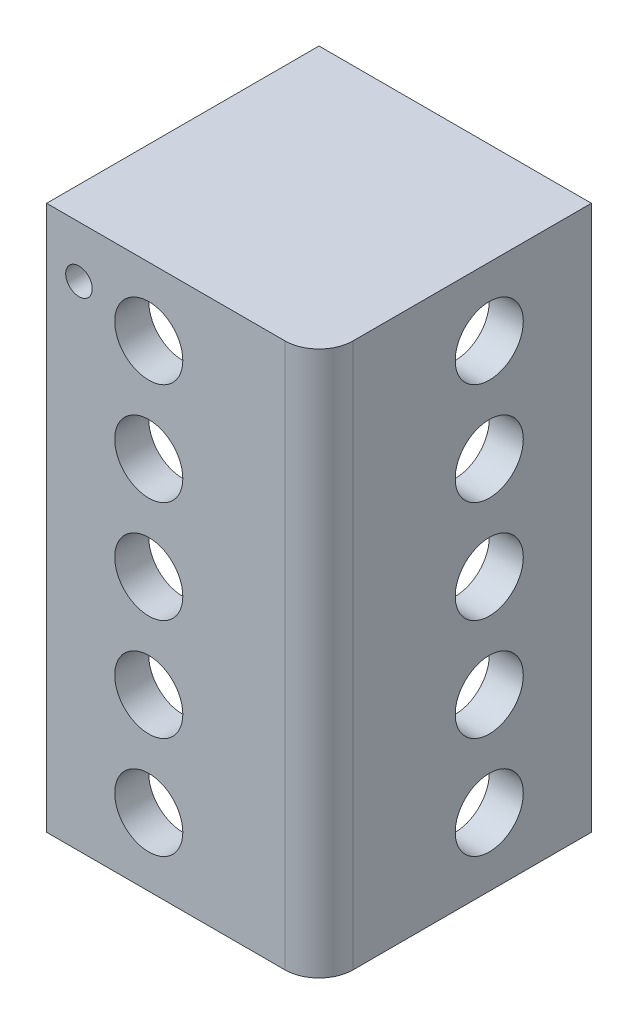
ISO-10303-21;
HEADER;
FILE_DESCRIPTION(('STEP AP214'),'2;1');
FILE_NAME('part.step','',(''),(''),'','','');
FILE_SCHEMA(('AUTOMOTIVE_DESIGN { 1 0 10303 214 1 1 1 1 }'));
ENDSEC;
DATA;
#1=APPLICATION_CONTEXT('core data for automotive mechanical design processes');
#2=APPLICATION_PROTOCOL_DEFINITION('international standard','automotive_design',2000,#1);
#3=PRODUCT_CONTEXT('',#1,'mechanical');
#4=PRODUCT('Part','Part','',(#3));
#5=PRODUCT_RELATED_PRODUCT_CATEGORY('part','',(#4));
#6=PRODUCT_DEFINITION_FORMATION('','',#4);
#7=PRODUCT_DEFINITION_CONTEXT('part definition',#1,'design');
#8=PRODUCT_DEFINITION('design','',#6,#7);
#9=PRODUCT_DEFINITION_SHAPE('','',#8);
#10=(LENGTH_UNIT() NAMED_UNIT(*) SI_UNIT(.MILLI.,.METRE.));
#11=(NAMED_UNIT(*) PLANE_ANGLE_UNIT() SI_UNIT($,.RADIAN.));
#12=(NAMED_UNIT(*) SI_UNIT($,.STERADIAN.) SOLID_ANGLE_UNIT());
#13=UNCERTAINTY_MEASURE_WITH_UNIT(LENGTH_MEASURE(1.E-05),#10,'distance_accuracy_value','');
#14=(GEOMETRIC_REPRESENTATION_CONTEXT(3) GLOBAL_UNCERTAINTY_ASSIGNED_CONTEXT((#13)) GLOBAL_UNIT_ASSIGNED_CONTEXT((#10,
#11,#12)) REPRESENTATION_CONTEXT('',''));
#15=CARTESIAN_POINT('',(0.,0.,0.));
#16=DIRECTION('',(0.,0.,1.));
#17=DIRECTION('',(1.,0.,0.));
#18=AXIS2_PLACEMENT_3D('',#15,#16,#17);
#19=CARTESIAN_POINT('',(0.,196.85,0.));
#20=DIRECTION('',(0.,1.,0.));
#21=DIRECTION('',(0.,0.,1.));
#22=AXIS2_PLACEMENT_3D('',#19,#20,#21);
#23=PLANE('',#22);
#24=DIRECTION('',(1.,0.,0.));
#25=VECTOR('',#24,1.);
#26=CARTESIAN_POINT('',(-41.3514223194748,196.85,-6.62789934354485));
#27=LINE('',#26,#25);
#28=CARTESIAN_POINT('',(-41.3514223194748,196.85,-6.62789934354485));
#29=VERTEX_POINT('',#28);
#30=CARTESIAN_POINT('',(-18.4914223194748,196.85,-6.62789934354485));
#31=VERTEX_POINT('',#30);
#32=EDGE_CURVE('E220',#29,#31,#27,.T.);
#33=ORIENTED_EDGE('',*,*,#32,.F.);
#34=DIRECTION('',(0.,0.,1.));
#35=VECTOR('',#34,1.);
#36=CARTESIAN_POINT('',(-41.3514223194748,196.85,-76.4778993435448));
#37=LINE('',#36,#35);
#38=CARTESIAN_POINT('',(-41.3514223194748,196.85,-18.5658993435449));
#39=VERTEX_POINT('',#38);
#40=EDGE_CURVE('E208',#39,#29,#37,.T.);
#41=ORIENTED_EDGE('',*,*,#40,.F.);
#42=DIRECTION('',(-1.,0.,0.));
#43=VECTOR('',#42,1.);
#44=CARTESIAN_POINT('',(-41.3514223194748,196.85,-18.5658993435449));
#45=LINE('',#44,#43);
#46=CARTESIAN_POINT('',(-18.4914223194748,196.85,-18.5658993435449));
#47=VERTEX_POINT('',#46);
#48=EDGE_CURVE('E240',#47,#39,#45,.T.);
#49=ORIENTED_EDGE('',*,*,#48,.F.);
#50=DIRECTION('',(0.,0.,1.));
#51=VECTOR('',#50,1.);
#52=CARTESIAN_POINT('',(-18.4914223194748,196.85,-18.5658993435449));
#53=LINE('',#52,#51);
#54=CARTESIAN_POINT('',(-18.4914223194748,196.85,-27.4558993435448));
#55=VERTEX_POINT('',#54);
#56=EDGE_CURVE('E243',#55,#47,#53,.T.);
#57=ORIENTED_EDGE('',*,*,#56,.F.);
#58=DIRECTION('',(1.,0.,0.));
#59=VECTOR('',#58,1.);
#60=CARTESIAN_POINT('',(-41.3514223194748,196.85,-27.4558993435448));
#61=LINE('',#60,#59);
#62=CARTESIAN_POINT('',(-41.3514223194748,196.85,-27.4558993435448));
#63=VERTEX_POINT('',#62);
#64=EDGE_CURVE('E247',#63,#55,#61,.T.);
#65=ORIENTED_EDGE('',*,*,#64,.F.);
#66=CARTESIAN_POINT('',(-41.3514223194748,196.85,-76.4778993435448));
#67=VERTEX_POINT('',#66);
#68=EDGE_CURVE('E211',#67,#63,#37,.T.);
#69=ORIENTED_EDGE('',*,*,#68,.F.);
#70=DIRECTION('',(-1.,0.,0.));
#71=VECTOR('',#70,1.);
#72=CARTESIAN_POINT('',(-41.3514223194748,196.85,-76.4778993435448));
#73=LINE('',#72,#71);
#74=CARTESIAN_POINT('',(47.5485776805252,196.85,-76.4778993435448));
#75=VERTEX_POINT('',#74);
#76=EDGE_CURVE('E298',#75,#67,#73,.T.);
#77=ORIENTED_EDGE('',*,*,#76,.F.);
#78=DIRECTION('',(0.,0.,-1.));
#79=VECTOR('',#78,1.);
#80=CARTESIAN_POINT('',(47.5485776805252,196.85,-76.4778993435448));
#81=LINE('',#80,#79);
#82=CARTESIAN_POINT('',(47.5485776805252,196.85,-0.277899343544857));
#83=VERTEX_POINT('',#82);
#84=EDGE_CURVE('E296',#83,#75,#81,.T.);
#85=ORIENTED_EDGE('',*,*,#84,.F.);
#86=CARTESIAN_POINT('',(34.8485776805252,196.85,-0.277899343544857));
#87=DIRECTION('',(0.,1.,0.));
#88=DIRECTION('',(0.,0.,1.));
#89=AXIS2_PLACEMENT_3D('',#86,#87,#88);
#90=CIRCLE('',#89,12.7);
#91=CARTESIAN_POINT('',(34.8485776805252,196.85,12.4221006564551));
#92=VERTEX_POINT('',#91);
#93=EDGE_CURVE('E347',#83,#92,#90,.F.);
#94=ORIENTED_EDGE('',*,*,#93,.T.);
#95=DIRECTION('',(1.,0.,0.));
#96=VECTOR('',#95,1.);
#97=CARTESIAN_POINT('',(-41.3514223194748,196.85,12.4221006564551));
#98=LINE('',#97,#96);
#99=CARTESIAN_POINT('',(-41.3514223194748,196.85,12.4221006564551));
#100=VERTEX_POINT('',#99);
#101=EDGE_CURVE('E206',#100,#92,#98,.T.);
#102=ORIENTED_EDGE('',*,*,#101,.F.);
#103=CARTESIAN_POINT('',(-41.3514223194748,196.85,2.26210065645514));
#104=VERTEX_POINT('',#103);
#105=EDGE_CURVE('E188',#104,#100,#37,.T.);
#106=ORIENTED_EDGE('',*,*,#105,.F.);
#107=DIRECTION('',(-1.,0.,0.));
#108=VECTOR('',#107,1.);
#109=CARTESIAN_POINT('',(-41.3514223194748,196.85,2.26210065645514));
#110=LINE('',#109,#108);
#111=CARTESIAN_POINT('',(-18.4914223194748,196.85,2.26210065645515));
#112=VERTEX_POINT('',#111);
#113=EDGE_CURVE('E203',#112,#104,#110,.T.);
#114=ORIENTED_EDGE('',*,*,#113,.F.);
#115=DIRECTION('',(0.,0.,1.));
#116=VECTOR('',#115,1.);
#117=CARTESIAN_POINT('',(-18.4914223194748,196.85,2.26210065645515));
#118=LINE('',#117,#116);
#119=EDGE_CURVE('E216',#31,#112,#118,.T.);
#120=ORIENTED_EDGE('',*,*,#119,.F.);
#121=EDGE_LOOP('',(#33,#41,#49,#57,#65,#69,#77,#85,#94,#102,#106,#114,#120));
#122=FACE_BOUND('',#121,.T.);
#123=ADVANCED_FACE('F43',(#122),#23,.F.);
#124=CARTESIAN_POINT('',(-41.3514223194748,203.2,-76.4778993435448));
#125=DIRECTION('',(1.,0.,0.));
#126=DIRECTION('',(0.,0.,-1.));
#127=AXIS2_PLACEMENT_3D('',#124,#125,#126);
#128=PLANE('',#127);
#129=DIRECTION('',(0.,1.,0.));
#130=VECTOR('',#129,1.);
#131=CARTESIAN_POINT('',(-41.3514223194748,171.45,-6.62789934354485));
#132=LINE('',#131,#130);
#133=CARTESIAN_POINT('',(-41.3514223194748,184.15,-6.62789934354485));
#134=VERTEX_POINT('',#133);
#135=EDGE_CURVE('E227',#134,#29,#132,.T.);
#136=ORIENTED_EDGE('',*,*,#135,.F.);
#137=DIRECTION('',(0.,0.,-1.));
#138=VECTOR('',#137,1.);
#139=CARTESIAN_POINT('',(-41.3514223194748,184.15,2.26210065645514));
#140=LINE('',#139,#138);
#141=CARTESIAN_POINT('',(-41.3514223194748,184.15,2.26210065645514));
#142=VERTEX_POINT('',#141);
#143=EDGE_CURVE('E191',#134,#142,#140,.F.);
#144=ORIENTED_EDGE('',*,*,#143,.T.);
#145=DIRECTION('',(0.,1.,0.));
#146=VECTOR('',#145,1.);
#147=CARTESIAN_POINT('',(-41.3514223194748,171.45,2.26210065645514));
#148=LINE('',#147,#146);
#149=EDGE_CURVE('E184',#142,#104,#148,.T.);
#150=ORIENTED_EDGE('',*,*,#149,.T.);
#151=ORIENTED_EDGE('',*,*,#105,.T.);
#152=DIRECTION('',(0.,-1.,0.));
#153=VECTOR('',#152,1.);
#154=CARTESIAN_POINT('',(-41.3514223194748,196.85,12.4221006564551));
#155=LINE('',#154,#153);
#156=CARTESIAN_POINT('',(-41.3514223194748,0.,12.4221006564551));
#157=VERTEX_POINT('',#156);
#158=EDGE_CURVE('E303',#100,#157,#155,.T.);
#159=ORIENTED_EDGE('',*,*,#158,.T.);
#160=DIRECTION('',(0.,0.,1.));
#161=VECTOR('',#160,1.);
#162=CARTESIAN_POINT('',(-41.3514223194748,0.,-76.4778993435448));
#163=LINE('',#162,#161);
#164=CARTESIAN_POINT('',(-41.3514223194748,0.,25.1221006564551));
#165=VERTEX_POINT('',#164);
#166=EDGE_CURVE('E305',#157,#165,#163,.T.);
#167=ORIENTED_EDGE('',*,*,#166,.T.);
#168=DIRECTION('',(0.,-1.,0.));
#169=VECTOR('',#168,1.);
#170=CARTESIAN_POINT('',(-41.3514223194748,203.2,25.1221006564551));
#171=LINE('',#170,#169);
#172=CARTESIAN_POINT('',(-41.3514223194748,203.2,25.1221006564551));
#173=VERTEX_POINT('',#172);
#174=EDGE_CURVE('E331',#173,#165,#171,.T.);
#175=ORIENTED_EDGE('',*,*,#174,.F.);
#176=DIRECTION('',(0.,0.,1.));
#177=VECTOR('',#176,1.);
#178=CARTESIAN_POINT('',(-41.3514223194748,203.2,-76.4778993435448));
#179=LINE('',#178,#177);
#180=CARTESIAN_POINT('',(-41.3514223194748,203.2,-76.4778993435448));
#181=VERTEX_POINT('',#180);
#182=EDGE_CURVE('E306',#181,#173,#179,.T.);
#183=ORIENTED_EDGE('',*,*,#182,.F.);
#184=DIRECTION('',(0.,-1.,0.));
#185=VECTOR('',#184,1.);
#186=CARTESIAN_POINT('',(-41.3514223194748,203.2,-76.4778993435448));
#187=LINE('',#186,#185);
#188=EDGE_CURVE('E317',#181,#67,#187,.T.);
#189=ORIENTED_EDGE('',*,*,#188,.T.);
#190=ORIENTED_EDGE('',*,*,#68,.T.);
#191=DIRECTION('',(0.,1.,0.));
#192=VECTOR('',#191,1.);
#193=CARTESIAN_POINT('',(-41.3514223194748,171.45,-27.4558993435448));
#194=LINE('',#193,#192);
#195=CARTESIAN_POINT('',(-41.3514223194748,184.15,-27.4558993435448));
#196=VERTEX_POINT('',#195);
#197=EDGE_CURVE('E230',#196,#63,#194,.T.);
#198=ORIENTED_EDGE('',*,*,#197,.F.);
#199=DIRECTION('',(0.,0.,-1.));
#200=VECTOR('',#199,1.);
#201=CARTESIAN_POINT('',(-41.3514223194748,184.15,-18.5658993435449));
#202=LINE('',#201,#200);
#203=CARTESIAN_POINT('',(-41.3514223194748,184.15,-18.5658993435449));
#204=VERTEX_POINT('',#203);
#205=EDGE_CURVE('E380',#196,#204,#202,.F.);
#206=ORIENTED_EDGE('',*,*,#205,.T.);
#207=DIRECTION('',(0.,1.,0.));
#208=VECTOR('',#207,1.);
#209=CARTESIAN_POINT('',(-41.3514223194748,171.45,-18.5658993435449));
#210=LINE('',#209,#208);
#211=EDGE_CURVE('E237',#204,#39,#210,.T.);
#212=ORIENTED_EDGE('',*,*,#211,.T.);
#213=ORIENTED_EDGE('',*,*,#40,.T.);
#214=EDGE_LOOP('',(#136,#144,#150,#151,#159,#167,#175,#183,#189,#190,#198,#206,#212,#213));
#215=FACE_BOUND('',#214,.T.);
#216=ADVANCED_FACE('F187',(#215),#128,.F.);
#217=CARTESIAN_POINT('',(-41.3514223194748,203.2,25.1221006564551));
#218=DIRECTION('',(0.,0.,-1.));
#219=DIRECTION('',(-1.,0.,0.));
#220=AXIS2_PLACEMENT_3D('',#217,#218,#219);
#221=PLANE('',#220);
#222=CARTESIAN_POINT('',(-29.2864223194748,184.023,25.1221006564552));
#223=DIRECTION('',(0.,0.,-1.));
#224=DIRECTION('',(-1.,0.,0.));
#225=AXIS2_PLACEMENT_3D('',#222,#223,#224);
#226=CIRCLE('',#225,4.953);
#227=CARTESIAN_POINT('',(-34.2394223194748,184.023,25.1221006564552));
#228=VERTEX_POINT('',#227);
#229=EDGE_CURVE('E671',#228,#228,#226,.T.);
#230=ORIENTED_EDGE('',*,*,#229,.T.);
#231=EDGE_LOOP('',(#230));
#232=FACE_BOUND('',#231,.T.);
#233=CARTESIAN_POINT('',(-3.25142231947483,177.8,25.1221006564551));
#234=DIRECTION('',(0.,0.,1.));
#235=DIRECTION('',(1.,0.,0.));
#236=AXIS2_PLACEMENT_3D('',#233,#234,#235);
#237=CIRCLE('',#236,12.7);
#238=CARTESIAN_POINT('',(9.44857768052517,177.8,25.1221006564551));
#239=VERTEX_POINT('',#238);
#240=EDGE_CURVE('E277',#239,#239,#237,.T.);
#241=ORIENTED_EDGE('',*,*,#240,.F.);
#242=EDGE_LOOP('',(#241));
#243=FACE_BOUND('',#242,.T.);
#244=CARTESIAN_POINT('',(-3.25142231947483,139.7,25.1221006564551));
#245=DIRECTION('',(0.,0.,1.));
#246=DIRECTION('',(1.,0.,0.));
#247=AXIS2_PLACEMENT_3D('',#244,#245,#246);
#248=CIRCLE('',#247,12.7);
#249=CARTESIAN_POINT('',(9.44857768052517,139.7,25.1221006564551));
#250=VERTEX_POINT('',#249);
#251=EDGE_CURVE('E281',#250,#250,#248,.T.);
#252=ORIENTED_EDGE('',*,*,#251,.F.);
#253=EDGE_LOOP('',(#252));
#254=FACE_BOUND('',#253,.T.);
#255=CARTESIAN_POINT('',(-3.25142231947483,101.6,25.1221006564551));
#256=DIRECTION('',(0.,0.,1.));
#257=DIRECTION('',(1.,0.,0.));
#258=AXIS2_PLACEMENT_3D('',#255,#256,#257);
#259=CIRCLE('',#258,12.7);
#260=CARTESIAN_POINT('',(9.44857768052517,101.6,25.1221006564551));
#261=VERTEX_POINT('',#260);
#262=EDGE_CURVE('E284',#261,#261,#259,.T.);
#263=ORIENTED_EDGE('',*,*,#262,.F.);
#264=EDGE_LOOP('',(#263));
#265=FACE_BOUND('',#264,.T.);
#266=CARTESIAN_POINT('',(-3.25142231947483,63.5,25.1221006564551));
#267=DIRECTION('',(0.,0.,1.));
#268=DIRECTION('',(1.,0.,0.));
#269=AXIS2_PLACEMENT_3D('',#266,#267,#268);
#270=CIRCLE('',#269,12.7);
#271=CARTESIAN_POINT('',(9.44857768052517,63.5,25.1221006564551));
#272=VERTEX_POINT('',#271);
#273=EDGE_CURVE('E287',#272,#272,#270,.T.);
#274=ORIENTED_EDGE('',*,*,#273,.F.);
#275=EDGE_LOOP('',(#274));
#276=FACE_BOUND('',#275,.T.);
#277=CARTESIAN_POINT('',(-3.25142231947483,25.4,25.1221006564551));
#278=DIRECTION('',(0.,0.,1.));
#279=DIRECTION('',(1.,0.,0.));
#280=AXIS2_PLACEMENT_3D('',#277,#278,#279);
#281=CIRCLE('',#280,12.7);
#282=CARTESIAN_POINT('',(9.44857768052517,25.4,25.1221006564551));
#283=VERTEX_POINT('',#282);
#284=EDGE_CURVE('E290',#283,#283,#281,.T.);
#285=ORIENTED_EDGE('',*,*,#284,.F.);
#286=EDGE_LOOP('',(#285));
#287=FACE_BOUND('',#286,.T.);
#288=DIRECTION('',(1.,0.,0.));
#289=VECTOR('',#288,1.);
#290=CARTESIAN_POINT('',(-41.3514223194748,0.,25.1221006564551));
#291=LINE('',#290,#289);
#292=CARTESIAN_POINT('',(47.5485776805251,0.,25.1221006564551));
#293=VERTEX_POINT('',#292);
#294=EDGE_CURVE('E319',#165,#293,#291,.T.);
#295=ORIENTED_EDGE('',*,*,#294,.T.);
#296=DIRECTION('',(0.,-1.,0.));
#297=VECTOR('',#296,1.);
#298=CARTESIAN_POINT('',(47.5485776805251,203.2,25.1221006564551));
#299=LINE('',#298,#297);
#300=CARTESIAN_POINT('',(47.5485776805251,203.2,25.1221006564551));
#301=VERTEX_POINT('',#300);
#302=EDGE_CURVE('E339',#293,#301,#299,.F.);
#303=ORIENTED_EDGE('',*,*,#302,.T.);
#304=DIRECTION('',(1.,0.,0.));
#305=VECTOR('',#304,1.);
#306=CARTESIAN_POINT('',(-41.3514223194748,203.2,25.1221006564551));
#307=LINE('',#306,#305);
#308=EDGE_CURVE('E309',#173,#301,#307,.T.);
#309=ORIENTED_EDGE('',*,*,#308,.F.);
#310=ORIENTED_EDGE('',*,*,#174,.T.);
#311=EDGE_LOOP('',(#295,#303,#309,#310));
#312=FACE_BOUND('',#311,.T.);
#313=ADVANCED_FACE('F441',(#232,#243,#254,#265,#276,#287,#312),#221,.F.);
#314=CARTESIAN_POINT('',(60.2485776805252,203.2,-76.4778993435448));
#315=DIRECTION('',(-1.,0.,0.));
#316=DIRECTION('',(0.,0.,1.));
#317=AXIS2_PLACEMENT_3D('',#314,#315,#316);
#318=PLANE('',#317);
#319=CARTESIAN_POINT('',(60.2485776805252,177.8,-38.3778993435448));
#320=DIRECTION('',(1.,0.,0.));
#321=DIRECTION('',(0.,0.,-1.));
#322=AXIS2_PLACEMENT_3D('',#319,#320,#321);
#323=CIRCLE('',#322,12.7);
#324=CARTESIAN_POINT('',(60.2485776805252,177.8,-51.0778993435448));
#325=VERTEX_POINT('',#324);
#326=EDGE_CURVE('E262',#325,#325,#323,.T.);
#327=ORIENTED_EDGE('',*,*,#326,.F.);
#328=EDGE_LOOP('',(#327));
#329=FACE_BOUND('',#328,.T.);
#330=CARTESIAN_POINT('',(60.2485776805252,139.7,-38.3778993435448));
#331=DIRECTION('',(1.,0.,0.));
#332=DIRECTION('',(0.,0.,-1.));
#333=AXIS2_PLACEMENT_3D('',#330,#331,#332);
#334=CIRCLE('',#333,12.7);
#335=CARTESIAN_POINT('',(60.2485776805252,139.7,-51.0778993435448));
#336=VERTEX_POINT('',#335);
#337=EDGE_CURVE('E266',#336,#336,#334,.T.);
#338=ORIENTED_EDGE('',*,*,#337,.F.);
#339=EDGE_LOOP('',(#338));
#340=FACE_BOUND('',#339,.T.);
#341=CARTESIAN_POINT('',(60.2485776805252,101.6,-38.3778993435448));
#342=DIRECTION('',(1.,0.,0.));
#343=DIRECTION('',(0.,0.,-1.));
#344=AXIS2_PLACEMENT_3D('',#341,#342,#343);
#345=CIRCLE('',#344,12.7);
#346=CARTESIAN_POINT('',(60.2485776805252,101.6,-51.0778993435448));
#347=VERTEX_POINT('',#346);
#348=EDGE_CURVE('E269',#347,#347,#345,.T.);
#349=ORIENTED_EDGE('',*,*,#348,.F.);
#350=EDGE_LOOP('',(#349));
#351=FACE_BOUND('',#350,.T.);
#352=CARTESIAN_POINT('',(60.2485776805252,63.5,-38.3778993435448));
#353=DIRECTION('',(1.,0.,0.));
#354=DIRECTION('',(0.,0.,-1.));
#355=AXIS2_PLACEMENT_3D('',#352,#353,#354);
#356=CIRCLE('',#355,12.7);
#357=CARTESIAN_POINT('',(60.2485776805252,63.5,-51.0778993435448));
#358=VERTEX_POINT('',#357);
#359=EDGE_CURVE('E272',#358,#358,#356,.T.);
#360=ORIENTED_EDGE('',*,*,#359,.F.);
#361=EDGE_LOOP('',(#360));
#362=FACE_BOUND('',#361,.T.);
#363=CARTESIAN_POINT('',(60.2485776805252,25.4,-38.3778993435448));
#364=DIRECTION('',(1.,0.,0.));
#365=DIRECTION('',(0.,0.,-1.));
#366=AXIS2_PLACEMENT_3D('',#363,#364,#365);
#367=CIRCLE('',#366,12.7);
#368=CARTESIAN_POINT('',(60.2485776805252,25.4,-51.0778993435448));
#369=VERTEX_POINT('',#368);
#370=EDGE_CURVE('E261',#369,#369,#367,.T.);
#371=ORIENTED_EDGE('',*,*,#370,.F.);
#372=EDGE_LOOP('',(#371));
#373=FACE_BOUND('',#372,.T.);
#374=DIRECTION('',(0.,0.,-1.));
#375=VECTOR('',#374,1.);
#376=CARTESIAN_POINT('',(60.2485776805252,203.2,-76.4778993435448));
#377=LINE('',#376,#375);
#378=CARTESIAN_POINT('',(60.2485776805252,203.2,12.4221006564551));
#379=VERTEX_POINT('',#378);
#380=CARTESIAN_POINT('',(60.2485776805252,203.2,-76.4778993435448));
#381=VERTEX_POINT('',#380);
#382=EDGE_CURVE('E313',#379,#381,#377,.T.);
#383=ORIENTED_EDGE('',*,*,#382,.F.);
#384=DIRECTION('',(0.,-1.,0.));
#385=VECTOR('',#384,1.);
#386=CARTESIAN_POINT('',(60.2485776805252,203.2,12.4221006564551));
#387=LINE('',#386,#385);
#388=CARTESIAN_POINT('',(60.2485776805252,0.,12.4221006564551));
#389=VERTEX_POINT('',#388);
#390=EDGE_CURVE('E334',#379,#389,#387,.T.);
#391=ORIENTED_EDGE('',*,*,#390,.T.);
#392=DIRECTION('',(0.,0.,-1.));
#393=VECTOR('',#392,1.);
#394=CARTESIAN_POINT('',(60.2485776805252,0.,-76.4778993435448));
#395=LINE('',#394,#393);
#396=CARTESIAN_POINT('',(60.2485776805252,0.,-76.4778993435448));
#397=VERTEX_POINT('',#396);
#398=EDGE_CURVE('E322',#389,#397,#395,.T.);
#399=ORIENTED_EDGE('',*,*,#398,.T.);
#400=DIRECTION('',(0.,-1.,0.));
#401=VECTOR('',#400,1.);
#402=CARTESIAN_POINT('',(60.2485776805252,203.2,-76.4778993435448));
#403=LINE('',#402,#401);
#404=EDGE_CURVE('E328',#381,#397,#403,.T.);
#405=ORIENTED_EDGE('',*,*,#404,.F.);
#406=EDGE_LOOP('',(#383,#391,#399,#405));
#407=FACE_BOUND('',#406,.T.);
#408=ADVANCED_FACE('F467',(#329,#340,#351,#362,#373,#407),#318,.F.);
#409=CARTESIAN_POINT('',(-41.3514223194748,203.2,-76.4778993435448));
#410=DIRECTION('',(0.,0.,1.));
#411=DIRECTION('',(1.,0.,0.));
#412=AXIS2_PLACEMENT_3D('',#409,#410,#411);
#413=PLANE('',#412);
#414=DIRECTION('',(-1.,0.,0.));
#415=VECTOR('',#414,1.);
#416=CARTESIAN_POINT('',(-41.3514223194748,0.,-76.4778993435448));
#417=LINE('',#416,#415);
#418=CARTESIAN_POINT('',(47.5485776805252,0.,-76.4778993435448));
#419=VERTEX_POINT('',#418);
#420=EDGE_CURVE('E310',#397,#419,#417,.T.);
#421=ORIENTED_EDGE('',*,*,#420,.T.);
#422=DIRECTION('',(0.,-1.,0.));
#423=VECTOR('',#422,1.);
#424=CARTESIAN_POINT('',(47.5485776805252,196.85,-76.4778993435448));
#425=LINE('',#424,#423);
#426=EDGE_CURVE('E301',#75,#419,#425,.T.);
#427=ORIENTED_EDGE('',*,*,#426,.F.);
#428=ORIENTED_EDGE('',*,*,#76,.T.);
#429=ORIENTED_EDGE('',*,*,#188,.F.);
#430=DIRECTION('',(-1.,0.,0.));
#431=VECTOR('',#430,1.);
#432=CARTESIAN_POINT('',(-41.3514223194748,203.2,-76.4778993435448));
#433=LINE('',#432,#431);
#434=EDGE_CURVE('E315',#381,#181,#433,.T.);
#435=ORIENTED_EDGE('',*,*,#434,.F.);
#436=ORIENTED_EDGE('',*,*,#404,.T.);
#437=EDGE_LOOP('',(#421,#427,#428,#429,#435,#436));
#438=FACE_BOUND('',#437,.T.);
#439=ADVANCED_FACE('F460',(#438),#413,.F.);
#440=CARTESIAN_POINT('',(0.,203.2,0.));
#441=DIRECTION('',(0.,1.,0.));
#442=DIRECTION('',(0.,0.,1.));
#443=AXIS2_PLACEMENT_3D('',#440,#441,#442);
#444=PLANE('',#443);
#445=ORIENTED_EDGE('',*,*,#308,.T.);
#446=CARTESIAN_POINT('',(47.5485776805252,203.2,12.4221006564551));
#447=DIRECTION('',(0.,1.,0.));
#448=DIRECTION('',(0.,0.,1.));
#449=AXIS2_PLACEMENT_3D('',#446,#447,#448);
#450=CIRCLE('',#449,12.7);
#451=EDGE_CURVE('E341',#301,#379,#450,.T.);
#452=ORIENTED_EDGE('',*,*,#451,.T.);
#453=ORIENTED_EDGE('',*,*,#382,.T.);
#454=ORIENTED_EDGE('',*,*,#434,.T.);
#455=ORIENTED_EDGE('',*,*,#182,.T.);
#456=EDGE_LOOP('',(#445,#452,#453,#454,#455));
#457=FACE_BOUND('',#456,.T.);
#458=ADVANCED_FACE('F457',(#457),#444,.T.);
#459=CARTESIAN_POINT('',(0.,0.,0.));
#460=DIRECTION('',(0.,1.,0.));
#461=DIRECTION('',(0.,0.,1.));
#462=AXIS2_PLACEMENT_3D('',#459,#460,#461);
#463=PLANE('',#462);
#464=CARTESIAN_POINT('',(34.8485776805252,0.,-0.277899343544854));
#465=DIRECTION('',(0.,1.,0.));
#466=DIRECTION('',(0.,0.,1.));
#467=AXIS2_PLACEMENT_3D('',#464,#465,#466);
#468=CIRCLE('',#467,12.7);
#469=CARTESIAN_POINT('',(34.8485776805251,0.,12.4221006564551));
#470=VERTEX_POINT('',#469);
#471=CARTESIAN_POINT('',(47.5485776805252,0.,-0.277899343544948));
#472=VERTEX_POINT('',#471);
#473=EDGE_CURVE('E255',#470,#472,#468,.T.);
#474=ORIENTED_EDGE('',*,*,#473,.T.);
#475=DIRECTION('',(0.,0.,-1.));
#476=VECTOR('',#475,1.);
#477=CARTESIAN_POINT('',(47.5485776805252,0.,-76.4778993435448));
#478=LINE('',#477,#476);
#479=EDGE_CURVE('E258',#472,#419,#478,.T.);
#480=ORIENTED_EDGE('',*,*,#479,.T.);
#481=ORIENTED_EDGE('',*,*,#420,.F.);
#482=ORIENTED_EDGE('',*,*,#398,.F.);
#483=CARTESIAN_POINT('',(47.5485776805252,0.,12.4221006564551));
#484=DIRECTION('',(0.,1.,0.));
#485=DIRECTION('',(0.,0.,1.));
#486=AXIS2_PLACEMENT_3D('',#483,#484,#485);
#487=CIRCLE('',#486,12.7);
#488=EDGE_CURVE('E337',#389,#293,#487,.F.);
#489=ORIENTED_EDGE('',*,*,#488,.T.);
#490=ORIENTED_EDGE('',*,*,#294,.F.);
#491=ORIENTED_EDGE('',*,*,#166,.F.);
#492=DIRECTION('',(1.,0.,0.));
#493=VECTOR('',#492,1.);
#494=CARTESIAN_POINT('',(-41.3514223194748,0.,12.4221006564551));
#495=LINE('',#494,#493);
#496=EDGE_CURVE('E229',#157,#470,#495,.T.);
#497=ORIENTED_EDGE('',*,*,#496,.T.);
#498=EDGE_LOOP('',(#474,#480,#481,#482,#489,#490,#491,#497));
#499=FACE_BOUND('',#498,.T.);
#500=ADVANCED_FACE('F455',(#499),#463,.F.);
#501=CARTESIAN_POINT('',(-41.3514223194748,196.85,12.4221006564551));
#502=DIRECTION('',(0.,0.,-1.));
#503=DIRECTION('',(-1.,0.,0.));
#504=AXIS2_PLACEMENT_3D('',#501,#502,#503);
#505=PLANE('',#504);
#506=CARTESIAN_POINT('',(-29.2864223194748,184.023,12.4221006564551));
#507=DIRECTION('',(0.,0.,-1.));
#508=DIRECTION('',(-1.,0.,0.));
#509=AXIS2_PLACEMENT_3D('',#506,#507,#508);
#510=CIRCLE('',#509,4.953);
#511=CARTESIAN_POINT('',(-34.2394223194748,184.023,12.4221006564551));
#512=VERTEX_POINT('',#511);
#513=EDGE_CURVE('E233',#512,#512,#510,.T.);
#514=ORIENTED_EDGE('',*,*,#513,.F.);
#515=EDGE_LOOP('',(#514));
#516=FACE_BOUND('',#515,.T.);
#517=CARTESIAN_POINT('',(-3.25142231947483,177.8,12.4221006564551));
#518=DIRECTION('',(0.,0.,-1.));
#519=DIRECTION('',(-1.,0.,0.));
#520=AXIS2_PLACEMENT_3D('',#517,#518,#519);
#521=CIRCLE('',#520,12.7);
#522=CARTESIAN_POINT('',(-15.9514223194748,177.8,12.4221006564551));
#523=VERTEX_POINT('',#522);
#524=EDGE_CURVE('E209',#523,#523,#521,.T.);
#525=ORIENTED_EDGE('',*,*,#524,.F.);
#526=EDGE_LOOP('',(#525));
#527=FACE_BOUND('',#526,.T.);
#528=CARTESIAN_POINT('',(-3.25142231947483,139.7,12.4221006564551));
#529=DIRECTION('',(0.,0.,-1.));
#530=DIRECTION('',(-1.,0.,0.));
#531=AXIS2_PLACEMENT_3D('',#528,#529,#530);
#532=CIRCLE('',#531,12.7);
#533=CARTESIAN_POINT('',(-15.9514223194748,139.7,12.4221006564551));
#534=VERTEX_POINT('',#533);
#535=EDGE_CURVE('E358',#534,#534,#532,.T.);
#536=ORIENTED_EDGE('',*,*,#535,.F.);
#537=EDGE_LOOP('',(#536));
#538=FACE_BOUND('',#537,.T.);
#539=CARTESIAN_POINT('',(-3.25142231947483,101.6,12.4221006564551));
#540=DIRECTION('',(0.,0.,-1.));
#541=DIRECTION('',(-1.,0.,0.));
#542=AXIS2_PLACEMENT_3D('',#539,#540,#541);
#543=CIRCLE('',#542,12.7);
#544=CARTESIAN_POINT('',(-15.9514223194748,101.6,12.4221006564551));
#545=VERTEX_POINT('',#544);
#546=EDGE_CURVE('E355',#545,#545,#543,.T.);
#547=ORIENTED_EDGE('',*,*,#546,.F.);
#548=EDGE_LOOP('',(#547));
#549=FACE_BOUND('',#548,.T.);
#550=CARTESIAN_POINT('',(-3.25142231947483,63.5,12.4221006564551));
#551=DIRECTION('',(0.,0.,-1.));
#552=DIRECTION('',(-1.,0.,0.));
#553=AXIS2_PLACEMENT_3D('',#550,#551,#552);
#554=CIRCLE('',#553,12.7);
#555=CARTESIAN_POINT('',(-15.9514223194748,63.5,12.4221006564551));
#556=VERTEX_POINT('',#555);
#557=EDGE_CURVE('E352',#556,#556,#554,.T.);
#558=ORIENTED_EDGE('',*,*,#557,.F.);
#559=EDGE_LOOP('',(#558));
#560=FACE_BOUND('',#559,.T.);
#561=CARTESIAN_POINT('',(-3.25142231947483,25.4,12.4221006564551));
#562=DIRECTION('',(0.,0.,-1.));
#563=DIRECTION('',(-1.,0.,0.));
#564=AXIS2_PLACEMENT_3D('',#561,#562,#563);
#565=CIRCLE('',#564,12.7);
#566=CARTESIAN_POINT('',(-15.9514223194748,25.4,12.4221006564551));
#567=VERTEX_POINT('',#566);
#568=EDGE_CURVE('E280',#567,#567,#565,.T.);
#569=ORIENTED_EDGE('',*,*,#568,.F.);
#570=EDGE_LOOP('',(#569));
#571=FACE_BOUND('',#570,.T.);
#572=ORIENTED_EDGE('',*,*,#101,.T.);
#573=DIRECTION('',(0.,-1.,0.));
#574=VECTOR('',#573,1.);
#575=CARTESIAN_POINT('',(34.8485776805252,6.34999999999999,12.4221006564551));
#576=LINE('',#575,#574);
#577=EDGE_CURVE('E343',#92,#470,#576,.T.);
#578=ORIENTED_EDGE('',*,*,#577,.T.);
#579=ORIENTED_EDGE('',*,*,#496,.F.);
#580=ORIENTED_EDGE('',*,*,#158,.F.);
#581=EDGE_LOOP('',(#572,#578,#579,#580));
#582=FACE_BOUND('',#581,.T.);
#583=ADVANCED_FACE('F451',(#516,#527,#538,#549,#560,#571,#582),#505,.T.);
#584=CARTESIAN_POINT('',(47.5485776805252,196.85,-76.4778993435448));
#585=DIRECTION('',(-1.,0.,0.));
#586=DIRECTION('',(0.,0.,1.));
#587=AXIS2_PLACEMENT_3D('',#584,#585,#586);
#588=PLANE('',#587);
#589=CARTESIAN_POINT('',(47.5485776805252,177.8,-38.3778993435448));
#590=DIRECTION('',(-1.,0.,0.));
#591=DIRECTION('',(0.,0.,1.));
#592=AXIS2_PLACEMENT_3D('',#589,#590,#591);
#593=CIRCLE('',#592,12.7);
#594=CARTESIAN_POINT('',(47.5485776805252,177.8,-25.6778993435448));
#595=VERTEX_POINT('',#594);
#596=EDGE_CURVE('E292',#595,#595,#593,.T.);
#597=ORIENTED_EDGE('',*,*,#596,.F.);
#598=EDGE_LOOP('',(#597));
#599=FACE_BOUND('',#598,.T.);
#600=CARTESIAN_POINT('',(47.5485776805252,139.7,-38.3778993435448));
#601=DIRECTION('',(-1.,0.,0.));
#602=DIRECTION('',(0.,0.,1.));
#603=AXIS2_PLACEMENT_3D('',#600,#601,#602);
#604=CIRCLE('',#603,12.7);
#605=CARTESIAN_POINT('',(47.5485776805252,139.7,-25.6778993435448));
#606=VERTEX_POINT('',#605);
#607=EDGE_CURVE('E371',#606,#606,#604,.T.);
#608=ORIENTED_EDGE('',*,*,#607,.F.);
#609=EDGE_LOOP('',(#608));
#610=FACE_BOUND('',#609,.T.);
#611=CARTESIAN_POINT('',(47.5485776805252,101.6,-38.3778993435448));
#612=DIRECTION('',(-1.,0.,0.));
#613=DIRECTION('',(0.,0.,1.));
#614=AXIS2_PLACEMENT_3D('',#611,#612,#613);
#615=CIRCLE('',#614,12.7);
#616=CARTESIAN_POINT('',(47.5485776805252,101.6,-25.6778993435448));
#617=VERTEX_POINT('',#616);
#618=EDGE_CURVE('E368',#617,#617,#615,.T.);
#619=ORIENTED_EDGE('',*,*,#618,.F.);
#620=EDGE_LOOP('',(#619));
#621=FACE_BOUND('',#620,.T.);
#622=CARTESIAN_POINT('',(47.5485776805252,63.5,-38.3778993435448));
#623=DIRECTION('',(-1.,0.,0.));
#624=DIRECTION('',(0.,0.,1.));
#625=AXIS2_PLACEMENT_3D('',#622,#623,#624);
#626=CIRCLE('',#625,12.7);
#627=CARTESIAN_POINT('',(47.5485776805252,63.5,-25.6778993435448));
#628=VERTEX_POINT('',#627);
#629=EDGE_CURVE('E365',#628,#628,#626,.T.);
#630=ORIENTED_EDGE('',*,*,#629,.F.);
#631=EDGE_LOOP('',(#630));
#632=FACE_BOUND('',#631,.T.);
#633=CARTESIAN_POINT('',(47.5485776805252,25.4,-38.3778993435448));
#634=DIRECTION('',(-1.,0.,0.));
#635=DIRECTION('',(0.,0.,1.));
#636=AXIS2_PLACEMENT_3D('',#633,#634,#635);
#637=CIRCLE('',#636,12.7);
#638=CARTESIAN_POINT('',(47.5485776805252,25.4,-25.6778993435448));
#639=VERTEX_POINT('',#638);
#640=EDGE_CURVE('E265',#639,#639,#637,.T.);
#641=ORIENTED_EDGE('',*,*,#640,.F.);
#642=EDGE_LOOP('',(#641));
#643=FACE_BOUND('',#642,.T.);
#644=ORIENTED_EDGE('',*,*,#426,.T.);
#645=ORIENTED_EDGE('',*,*,#479,.F.);
#646=DIRECTION('',(0.,-1.,0.));
#647=VECTOR('',#646,1.);
#648=CARTESIAN_POINT('',(47.5485776805252,196.85,-0.277899343544859));
#649=LINE('',#648,#647);
#650=EDGE_CURVE('E345',#472,#83,#649,.F.);
#651=ORIENTED_EDGE('',*,*,#650,.T.);
#652=ORIENTED_EDGE('',*,*,#84,.T.);
#653=EDGE_LOOP('',(#644,#645,#651,#652));
#654=FACE_BOUND('',#653,.T.);
#655=ADVANCED_FACE('F447',(#599,#610,#621,#632,#643,#654),#588,.T.);
#656=CARTESIAN_POINT('',(47.5485776805252,203.2,12.4221006564551));
#657=DIRECTION('',(0.,-1.,0.));
#658=DIRECTION('',(0.,0.,-1.));
#659=AXIS2_PLACEMENT_3D('',#656,#657,#658);
#660=CYLINDRICAL_SURFACE('',#659,12.7);
#661=ORIENTED_EDGE('',*,*,#451,.F.);
#662=ORIENTED_EDGE('',*,*,#302,.F.);
#663=ORIENTED_EDGE('',*,*,#488,.F.);
#664=ORIENTED_EDGE('',*,*,#390,.F.);
#665=EDGE_LOOP('',(#661,#662,#663,#664));
#666=FACE_BOUND('',#665,.T.);
#667=ADVANCED_FACE('F450',(#666),#660,.T.);
#668=CARTESIAN_POINT('',(34.8485776805252,196.85,-0.277899343544857));
#669=DIRECTION('',(0.,1.,0.));
#670=DIRECTION('',(0.,0.,1.));
#671=AXIS2_PLACEMENT_3D('',#668,#669,#670);
#672=CYLINDRICAL_SURFACE('',#671,12.7);
#673=ORIENTED_EDGE('',*,*,#93,.F.);
#674=ORIENTED_EDGE('',*,*,#650,.F.);
#675=ORIENTED_EDGE('',*,*,#473,.F.);
#676=ORIENTED_EDGE('',*,*,#577,.F.);
#677=EDGE_LOOP('',(#673,#674,#675,#676));
#678=FACE_BOUND('',#677,.T.);
#679=ADVANCED_FACE('F476',(#678),#672,.F.);
#680=CARTESIAN_POINT('',(-3.25142231947483,25.4,-76.4778993435448));
#681=DIRECTION('',(0.,0.,1.));
#682=DIRECTION('',(1.,0.,0.));
#683=AXIS2_PLACEMENT_3D('',#680,#681,#682);
#684=CYLINDRICAL_SURFACE('',#683,12.7);
#685=ORIENTED_EDGE('',*,*,#568,.T.);
#686=EDGE_LOOP('',(#685));
#687=FACE_BOUND('',#686,.T.);
#688=ORIENTED_EDGE('',*,*,#284,.T.);
#689=EDGE_LOOP('',(#688));
#690=FACE_BOUND('',#689,.T.);
#691=ADVANCED_FACE('F445',(#687,#690),#684,.F.);
#692=CARTESIAN_POINT('',(-3.25142231947483,63.5,-76.4778993435448));
#693=DIRECTION('',(0.,0.,1.));
#694=DIRECTION('',(1.,0.,0.));
#695=AXIS2_PLACEMENT_3D('',#692,#693,#694);
#696=CYLINDRICAL_SURFACE('',#695,12.7);
#697=ORIENTED_EDGE('',*,*,#557,.T.);
#698=EDGE_LOOP('',(#697));
#699=FACE_BOUND('',#698,.T.);
#700=ORIENTED_EDGE('',*,*,#273,.T.);
#701=EDGE_LOOP('',(#700));
#702=FACE_BOUND('',#701,.T.);
#703=ADVANCED_FACE('F607',(#699,#702),#696,.F.);
#704=CARTESIAN_POINT('',(-3.25142231947483,101.6,-76.4778993435448));
#705=DIRECTION('',(0.,0.,1.));
#706=DIRECTION('',(1.,0.,0.));
#707=AXIS2_PLACEMENT_3D('',#704,#705,#706);
#708=CYLINDRICAL_SURFACE('',#707,12.7);
#709=ORIENTED_EDGE('',*,*,#546,.T.);
#710=EDGE_LOOP('',(#709));
#711=FACE_BOUND('',#710,.T.);
#712=ORIENTED_EDGE('',*,*,#262,.T.);
#713=EDGE_LOOP('',(#712));
#714=FACE_BOUND('',#713,.T.);
#715=ADVANCED_FACE('F604',(#711,#714),#708,.F.);
#716=CARTESIAN_POINT('',(-3.25142231947483,139.7,-76.4778993435448));
#717=DIRECTION('',(0.,0.,1.));
#718=DIRECTION('',(1.,0.,0.));
#719=AXIS2_PLACEMENT_3D('',#716,#717,#718);
#720=CYLINDRICAL_SURFACE('',#719,12.7);
#721=ORIENTED_EDGE('',*,*,#535,.T.);
#722=EDGE_LOOP('',(#721));
#723=FACE_BOUND('',#722,.T.);
#724=ORIENTED_EDGE('',*,*,#251,.T.);
#725=EDGE_LOOP('',(#724));
#726=FACE_BOUND('',#725,.T.);
#727=ADVANCED_FACE('F600',(#723,#726),#720,.F.);
#728=CARTESIAN_POINT('',(-3.25142231947483,177.8,-76.4778993435448));
#729=DIRECTION('',(0.,0.,1.));
#730=DIRECTION('',(1.,0.,0.));
#731=AXIS2_PLACEMENT_3D('',#728,#729,#730);
#732=CYLINDRICAL_SURFACE('',#731,12.7);
#733=ORIENTED_EDGE('',*,*,#524,.T.);
#734=EDGE_LOOP('',(#733));
#735=FACE_BOUND('',#734,.T.);
#736=ORIENTED_EDGE('',*,*,#240,.T.);
#737=EDGE_LOOP('',(#736));
#738=FACE_BOUND('',#737,.T.);
#739=ADVANCED_FACE('F596',(#735,#738),#732,.F.);
#740=CARTESIAN_POINT('',(-41.3514223194748,25.4,-38.3778993435448));
#741=DIRECTION('',(1.,0.,0.));
#742=DIRECTION('',(0.,0.,-1.));
#743=AXIS2_PLACEMENT_3D('',#740,#741,#742);
#744=CYLINDRICAL_SURFACE('',#743,12.7);
#745=ORIENTED_EDGE('',*,*,#640,.T.);
#746=EDGE_LOOP('',(#745));
#747=FACE_BOUND('',#746,.T.);
#748=ORIENTED_EDGE('',*,*,#370,.T.);
#749=EDGE_LOOP('',(#748));
#750=FACE_BOUND('',#749,.T.);
#751=ADVANCED_FACE('F592',(#747,#750),#744,.F.);
#752=CARTESIAN_POINT('',(-41.3514223194748,63.5,-38.3778993435448));
#753=DIRECTION('',(1.,0.,0.));
#754=DIRECTION('',(0.,0.,-1.));
#755=AXIS2_PLACEMENT_3D('',#752,#753,#754);
#756=CYLINDRICAL_SURFACE('',#755,12.7);
#757=ORIENTED_EDGE('',*,*,#629,.T.);
#758=EDGE_LOOP('',(#757));
#759=FACE_BOUND('',#758,.T.);
#760=ORIENTED_EDGE('',*,*,#359,.T.);
#761=EDGE_LOOP('',(#760));
#762=FACE_BOUND('',#761,.T.);
#763=ADVANCED_FACE('F588',(#759,#762),#756,.F.);
#764=CARTESIAN_POINT('',(-41.3514223194748,101.6,-38.3778993435448));
#765=DIRECTION('',(1.,0.,0.));
#766=DIRECTION('',(0.,0.,-1.));
#767=AXIS2_PLACEMENT_3D('',#764,#765,#766);
#768=CYLINDRICAL_SURFACE('',#767,12.7);
#769=ORIENTED_EDGE('',*,*,#618,.T.);
#770=EDGE_LOOP('',(#769));
#771=FACE_BOUND('',#770,.T.);
#772=ORIENTED_EDGE('',*,*,#348,.T.);
#773=EDGE_LOOP('',(#772));
#774=FACE_BOUND('',#773,.T.);
#775=ADVANCED_FACE('F584',(#771,#774),#768,.F.);
#776=CARTESIAN_POINT('',(-41.3514223194748,139.7,-38.3778993435448));
#777=DIRECTION('',(1.,0.,0.));
#778=DIRECTION('',(0.,0.,-1.));
#779=AXIS2_PLACEMENT_3D('',#776,#777,#778);
#780=CYLINDRICAL_SURFACE('',#779,12.7);
#781=ORIENTED_EDGE('',*,*,#607,.T.);
#782=EDGE_LOOP('',(#781));
#783=FACE_BOUND('',#782,.T.);
#784=ORIENTED_EDGE('',*,*,#337,.T.);
#785=EDGE_LOOP('',(#784));
#786=FACE_BOUND('',#785,.T.);
#787=ADVANCED_FACE('F580',(#783,#786),#780,.F.);
#788=CARTESIAN_POINT('',(-41.3514223194748,177.8,-38.3778993435448));
#789=DIRECTION('',(1.,0.,0.));
#790=DIRECTION('',(0.,0.,-1.));
#791=AXIS2_PLACEMENT_3D('',#788,#789,#790);
#792=CYLINDRICAL_SURFACE('',#791,12.7);
#793=ORIENTED_EDGE('',*,*,#596,.T.);
#794=EDGE_LOOP('',(#793));
#795=FACE_BOUND('',#794,.T.);
#796=ORIENTED_EDGE('',*,*,#326,.T.);
#797=EDGE_LOOP('',(#796));
#798=FACE_BOUND('',#797,.T.);
#799=ADVANCED_FACE('F572',(#795,#798),#792,.F.);
#800=CARTESIAN_POINT('',(-41.3514223194748,171.45,-27.4558993435448));
#801=DIRECTION('',(0.,0.,1.));
#802=DIRECTION('',(1.,0.,0.));
#803=AXIS2_PLACEMENT_3D('',#800,#801,#802);
#804=PLANE('',#803);
#805=CARTESIAN_POINT('',(-29.2864223194748,184.023,-27.4558993435449));
#806=DIRECTION('',(0.,0.,1.));
#807=DIRECTION('',(1.,0.,0.));
#808=AXIS2_PLACEMENT_3D('',#805,#806,#807);
#809=CIRCLE('',#808,4.953);
#810=CARTESIAN_POINT('',(-24.3334223194748,184.023,-27.4558993435449));
#811=VERTEX_POINT('',#810);
#812=EDGE_CURVE('E662',#811,#811,#809,.T.);
#813=ORIENTED_EDGE('',*,*,#812,.T.);
#814=EDGE_LOOP('',(#813));
#815=FACE_BOUND('',#814,.T.);
#816=DIRECTION('',(0.,1.,0.));
#817=VECTOR('',#816,1.);
#818=CARTESIAN_POINT('',(-18.4914223194748,171.45,-27.4558993435448));
#819=LINE('',#818,#817);
#820=CARTESIAN_POINT('',(-18.4914223194748,177.8,-27.4558993435448));
#821=VERTEX_POINT('',#820);
#822=EDGE_CURVE('E232',#821,#55,#819,.T.);
#823=ORIENTED_EDGE('',*,*,#822,.F.);
#824=CARTESIAN_POINT('',(-24.8414223194748,177.8,-27.4558993435448));
#825=DIRECTION('',(0.,0.,1.));
#826=DIRECTION('',(1.,0.,0.));
#827=AXIS2_PLACEMENT_3D('',#824,#825,#826);
#828=CIRCLE('',#827,6.35);
#829=CARTESIAN_POINT('',(-24.8414223194748,171.45,-27.4558993435448));
#830=VERTEX_POINT('',#829);
#831=EDGE_CURVE('E11',#821,#830,#828,.F.);
#832=ORIENTED_EDGE('',*,*,#831,.T.);
#833=DIRECTION('',(1.,0.,0.));
#834=VECTOR('',#833,1.);
#835=CARTESIAN_POINT('',(-41.3514223194748,171.45,-27.4558993435448));
#836=LINE('',#835,#834);
#837=CARTESIAN_POINT('',(-28.6514223194748,171.45,-27.4558993435448));
#838=VERTEX_POINT('',#837);
#839=EDGE_CURVE('E244',#838,#830,#836,.T.);
#840=ORIENTED_EDGE('',*,*,#839,.F.);
#841=CARTESIAN_POINT('',(-28.6514223194748,184.15,-27.4558993435448));
#842=DIRECTION('',(0.,0.,1.));
#843=DIRECTION('',(1.,0.,0.));
#844=AXIS2_PLACEMENT_3D('',#841,#842,#843);
#845=CIRCLE('',#844,12.7);
#846=EDGE_CURVE('E388',#838,#196,#845,.F.);
#847=ORIENTED_EDGE('',*,*,#846,.T.);
#848=ORIENTED_EDGE('',*,*,#197,.T.);
#849=ORIENTED_EDGE('',*,*,#64,.T.);
#850=EDGE_LOOP('',(#823,#832,#840,#847,#848,#849));
#851=FACE_BOUND('',#850,.T.);
#852=ADVANCED_FACE('F420',(#815,#851),#804,.F.);
#853=CARTESIAN_POINT('',(-18.4914223194748,171.45,-18.5658993435449));
#854=DIRECTION('',(-1.,0.,0.));
#855=DIRECTION('',(0.,0.,1.));
#856=AXIS2_PLACEMENT_3D('',#853,#854,#855);
#857=PLANE('',#856);
#858=DIRECTION('',(0.,1.,0.));
#859=VECTOR('',#858,1.);
#860=CARTESIAN_POINT('',(-18.4914223194748,171.45,-18.5658993435449));
#861=LINE('',#860,#859);
#862=CARTESIAN_POINT('',(-18.4914223194748,177.8,-18.5658993435449));
#863=VERTEX_POINT('',#862);
#864=EDGE_CURVE('E235',#863,#47,#861,.T.);
#865=ORIENTED_EDGE('',*,*,#864,.F.);
#866=DIRECTION('',(0.,0.,1.));
#867=VECTOR('',#866,1.);
#868=CARTESIAN_POINT('',(-18.4914223194748,177.8,-27.4558993435448));
#869=LINE('',#868,#867);
#870=EDGE_CURVE('E52',#863,#821,#869,.F.);
#871=ORIENTED_EDGE('',*,*,#870,.T.);
#872=ORIENTED_EDGE('',*,*,#822,.T.);
#873=ORIENTED_EDGE('',*,*,#56,.T.);
#874=EDGE_LOOP('',(#865,#871,#872,#873));
#875=FACE_BOUND('',#874,.T.);
#876=ADVANCED_FACE('F495',(#875),#857,.F.);
#877=CARTESIAN_POINT('',(-41.3514223194748,171.45,-18.5658993435449));
#878=DIRECTION('',(0.,0.,-1.));
#879=DIRECTION('',(-1.,0.,0.));
#880=AXIS2_PLACEMENT_3D('',#877,#878,#879);
#881=PLANE('',#880);
#882=CARTESIAN_POINT('',(-29.2864223194748,184.023,-18.5658993435449));
#883=DIRECTION('',(0.,0.,-1.));
#884=DIRECTION('',(-1.,0.,0.));
#885=AXIS2_PLACEMENT_3D('',#882,#883,#884);
#886=CIRCLE('',#885,4.953);
#887=CARTESIAN_POINT('',(-34.2394223194748,184.023,-18.5658993435449));
#888=VERTEX_POINT('',#887);
#889=EDGE_CURVE('E665',#888,#888,#886,.T.);
#890=ORIENTED_EDGE('',*,*,#889,.T.);
#891=EDGE_LOOP('',(#890));
#892=FACE_BOUND('',#891,.T.);
#893=DIRECTION('',(-1.,0.,0.));
#894=VECTOR('',#893,1.);
#895=CARTESIAN_POINT('',(-41.3514223194748,171.45,-18.5658993435449));
#896=LINE('',#895,#894);
#897=CARTESIAN_POINT('',(-24.8414223194748,171.45,-18.5658993435449));
#898=VERTEX_POINT('',#897);
#899=CARTESIAN_POINT('',(-28.6514223194748,171.45,-18.5658993435449));
#900=VERTEX_POINT('',#899);
#901=EDGE_CURVE('E239',#898,#900,#896,.T.);
#902=ORIENTED_EDGE('',*,*,#901,.F.);
#903=CARTESIAN_POINT('',(-24.8414223194748,177.8,-18.5658993435449));
#904=DIRECTION('',(0.,0.,-1.));
#905=DIRECTION('',(-1.,0.,0.));
#906=AXIS2_PLACEMENT_3D('',#903,#904,#905);
#907=CIRCLE('',#906,6.35);
#908=EDGE_CURVE('E66',#898,#863,#907,.F.);
#909=ORIENTED_EDGE('',*,*,#908,.T.);
#910=ORIENTED_EDGE('',*,*,#864,.T.);
#911=ORIENTED_EDGE('',*,*,#48,.T.);
#912=ORIENTED_EDGE('',*,*,#211,.F.);
#913=CARTESIAN_POINT('',(-28.6514223194748,184.15,-18.5658993435449));
#914=DIRECTION('',(0.,0.,-1.));
#915=DIRECTION('',(-1.,0.,0.));
#916=AXIS2_PLACEMENT_3D('',#913,#914,#915);
#917=CIRCLE('',#916,12.7);
#918=EDGE_CURVE('E390',#204,#900,#917,.F.);
#919=ORIENTED_EDGE('',*,*,#918,.T.);
#920=EDGE_LOOP('',(#902,#909,#910,#911,#912,#919));
#921=FACE_BOUND('',#920,.T.);
#922=ADVANCED_FACE('F412',(#892,#921),#881,.F.);
#923=CARTESIAN_POINT('',(0.,171.45,0.));
#924=DIRECTION('',(0.,-1.,0.));
#925=DIRECTION('',(0.,0.,-1.));
#926=AXIS2_PLACEMENT_3D('',#923,#924,#925);
#927=PLANE('',#926);
#928=ORIENTED_EDGE('',*,*,#839,.T.);
#929=DIRECTION('',(0.,0.,1.));
#930=VECTOR('',#929,1.);
#931=CARTESIAN_POINT('',(-24.8414223194748,171.45,-18.5658993435449));
#932=LINE('',#931,#930);
#933=EDGE_CURVE('E402',#830,#898,#932,.T.);
#934=ORIENTED_EDGE('',*,*,#933,.T.);
#935=ORIENTED_EDGE('',*,*,#901,.T.);
#936=DIRECTION('',(0.,0.,-1.));
#937=VECTOR('',#936,1.);
#938=CARTESIAN_POINT('',(-28.6514223194748,171.45,-27.4558993435448));
#939=LINE('',#938,#937);
#940=EDGE_CURVE('E385',#900,#838,#939,.T.);
#941=ORIENTED_EDGE('',*,*,#940,.T.);
#942=EDGE_LOOP('',(#928,#934,#935,#941));
#943=FACE_BOUND('',#942,.T.);
#944=ADVANCED_FACE('F408',(#943),#927,.T.);
#945=CARTESIAN_POINT('',(-41.3514223194748,171.45,-6.62789934354485));
#946=DIRECTION('',(0.,0.,1.));
#947=DIRECTION('',(1.,0.,0.));
#948=AXIS2_PLACEMENT_3D('',#945,#946,#947);
#949=PLANE('',#948);
#950=CARTESIAN_POINT('',(-29.2864223194748,184.023,-6.62789934354485));
#951=DIRECTION('',(0.,0.,1.));
#952=DIRECTION('',(1.,0.,0.));
#953=AXIS2_PLACEMENT_3D('',#950,#951,#952);
#954=CIRCLE('',#953,4.953);
#955=CARTESIAN_POINT('',(-24.3334223194748,184.023,-6.62789934354485));
#956=VERTEX_POINT('',#955);
#957=EDGE_CURVE('E668',#956,#956,#954,.T.);
#958=ORIENTED_EDGE('',*,*,#957,.T.);
#959=EDGE_LOOP('',(#958));
#960=FACE_BOUND('',#959,.T.);
#961=DIRECTION('',(0.,1.,0.));
#962=VECTOR('',#961,1.);
#963=CARTESIAN_POINT('',(-18.4914223194748,171.45,-6.62789934354485));
#964=LINE('',#963,#962);
#965=CARTESIAN_POINT('',(-18.4914223194748,177.8,-6.62789934354485));
#966=VERTEX_POINT('',#965);
#967=EDGE_CURVE('E225',#966,#31,#964,.T.);
#968=ORIENTED_EDGE('',*,*,#967,.F.);
#969=CARTESIAN_POINT('',(-24.8414223194748,177.8,-6.62789934354485));
#970=DIRECTION('',(0.,0.,1.));
#971=DIRECTION('',(1.,0.,0.));
#972=AXIS2_PLACEMENT_3D('',#969,#970,#971);
#973=CIRCLE('',#972,6.35);
#974=CARTESIAN_POINT('',(-24.8414223194748,171.45,-6.62789934354485));
#975=VERTEX_POINT('',#974);
#976=EDGE_CURVE('E400',#966,#975,#973,.F.);
#977=ORIENTED_EDGE('',*,*,#976,.T.);
#978=DIRECTION('',(1.,0.,0.));
#979=VECTOR('',#978,1.);
#980=CARTESIAN_POINT('',(-41.3514223194748,171.45,-6.62789934354485));
#981=LINE('',#980,#979);
#982=CARTESIAN_POINT('',(-28.6514223194748,171.45,-6.62789934354485));
#983=VERTEX_POINT('',#982);
#984=EDGE_CURVE('E215',#983,#975,#981,.T.);
#985=ORIENTED_EDGE('',*,*,#984,.F.);
#986=CARTESIAN_POINT('',(-28.6514223194748,184.15,-6.62789934354485));
#987=DIRECTION('',(0.,0.,1.));
#988=DIRECTION('',(1.,0.,0.));
#989=AXIS2_PLACEMENT_3D('',#986,#987,#988);
#990=CIRCLE('',#989,12.7);
#991=EDGE_CURVE('E378',#983,#134,#990,.F.);
#992=ORIENTED_EDGE('',*,*,#991,.T.);
#993=ORIENTED_EDGE('',*,*,#135,.T.);
#994=ORIENTED_EDGE('',*,*,#32,.T.);
#995=EDGE_LOOP('',(#968,#977,#985,#992,#993,#994));
#996=FACE_BOUND('',#995,.T.);
#997=ADVANCED_FACE('F508',(#960,#996),#949,.F.);
#998=CARTESIAN_POINT('',(-18.4914223194748,171.45,2.26210065645515));
#999=DIRECTION('',(-1.,0.,0.));
#1000=DIRECTION('',(0.,0.,1.));
#1001=AXIS2_PLACEMENT_3D('',#998,#999,#1000);
#1002=PLANE('',#1001);
#1003=DIRECTION('',(0.,1.,0.));
#1004=VECTOR('',#1003,1.);
#1005=CARTESIAN_POINT('',(-18.4914223194748,171.45,2.26210065645515));
#1006=LINE('',#1005,#1004);
#1007=CARTESIAN_POINT('',(-18.4914223194748,177.8,2.26210065645515));
#1008=VERTEX_POINT('',#1007);
#1009=EDGE_CURVE('E196',#1008,#112,#1006,.T.);
#1010=ORIENTED_EDGE('',*,*,#1009,.F.);
#1011=DIRECTION('',(0.,0.,1.));
#1012=VECTOR('',#1011,1.);
#1013=CARTESIAN_POINT('',(-18.4914223194748,177.8,-6.62789934354485));
#1014=LINE('',#1013,#1012);
#1015=EDGE_CURVE('E398',#1008,#966,#1014,.F.);
#1016=ORIENTED_EDGE('',*,*,#1015,.T.);
#1017=ORIENTED_EDGE('',*,*,#967,.T.);
#1018=ORIENTED_EDGE('',*,*,#119,.T.);
#1019=EDGE_LOOP('',(#1010,#1016,#1017,#1018));
#1020=FACE_BOUND('',#1019,.T.);
#1021=ADVANCED_FACE('F514',(#1020),#1002,.F.);
#1022=CARTESIAN_POINT('',(-41.3514223194748,171.45,2.26210065645514));
#1023=DIRECTION('',(0.,0.,-1.));
#1024=DIRECTION('',(-1.,0.,0.));
#1025=AXIS2_PLACEMENT_3D('',#1022,#1023,#1024);
#1026=PLANE('',#1025);
#1027=CARTESIAN_POINT('',(-29.2864223194748,184.023,2.26210065645514));
#1028=DIRECTION('',(0.,0.,-1.));
#1029=DIRECTION('',(-1.,0.,0.));
#1030=AXIS2_PLACEMENT_3D('',#1027,#1028,#1029);
#1031=CIRCLE('',#1030,4.953);
#1032=CARTESIAN_POINT('',(-34.2394223194748,184.023,2.26210065645514));
#1033=VERTEX_POINT('',#1032);
#1034=EDGE_CURVE('E47',#1033,#1033,#1031,.T.);
#1035=ORIENTED_EDGE('',*,*,#1034,.T.);
#1036=EDGE_LOOP('',(#1035));
#1037=FACE_BOUND('',#1036,.T.);
#1038=DIRECTION('',(-1.,0.,0.));
#1039=VECTOR('',#1038,1.);
#1040=CARTESIAN_POINT('',(-41.3514223194748,171.45,2.26210065645514));
#1041=LINE('',#1040,#1039);
#1042=CARTESIAN_POINT('',(-24.8414223194748,171.45,2.26210065645514));
#1043=VERTEX_POINT('',#1042);
#1044=CARTESIAN_POINT('',(-28.6514223194748,171.45,2.26210065645514));
#1045=VERTEX_POINT('',#1044);
#1046=EDGE_CURVE('E197',#1043,#1045,#1041,.T.);
#1047=ORIENTED_EDGE('',*,*,#1046,.F.);
#1048=CARTESIAN_POINT('',(-24.8414223194748,177.8,2.26210065645514));
#1049=DIRECTION('',(0.,0.,-1.));
#1050=DIRECTION('',(-1.,0.,0.));
#1051=AXIS2_PLACEMENT_3D('',#1048,#1049,#1050);
#1052=CIRCLE('',#1051,6.35);
#1053=EDGE_CURVE('E396',#1043,#1008,#1052,.F.);
#1054=ORIENTED_EDGE('',*,*,#1053,.T.);
#1055=ORIENTED_EDGE('',*,*,#1009,.T.);
#1056=ORIENTED_EDGE('',*,*,#113,.T.);
#1057=ORIENTED_EDGE('',*,*,#149,.F.);
#1058=CARTESIAN_POINT('',(-28.6514223194748,184.15,2.26210065645514));
#1059=DIRECTION('',(0.,0.,-1.));
#1060=DIRECTION('',(-1.,0.,0.));
#1061=AXIS2_PLACEMENT_3D('',#1058,#1059,#1060);
#1062=CIRCLE('',#1061,12.7);
#1063=EDGE_CURVE('E383',#142,#1045,#1062,.F.);
#1064=ORIENTED_EDGE('',*,*,#1063,.T.);
#1065=EDGE_LOOP('',(#1047,#1054,#1055,#1056,#1057,#1064));
#1066=FACE_BOUND('',#1065,.T.);
#1067=ADVANCED_FACE('F213',(#1037,#1066),#1026,.F.);
#1068=CARTESIAN_POINT('',(0.,171.45,0.));
#1069=DIRECTION('',(0.,-1.,0.));
#1070=DIRECTION('',(0.,0.,-1.));
#1071=AXIS2_PLACEMENT_3D('',#1068,#1069,#1070);
#1072=PLANE('',#1071);
#1073=ORIENTED_EDGE('',*,*,#984,.T.);
#1074=DIRECTION('',(0.,0.,1.));
#1075=VECTOR('',#1074,1.);
#1076=CARTESIAN_POINT('',(-24.8414223194748,171.45,2.26210065645515));
#1077=LINE('',#1076,#1075);
#1078=EDGE_CURVE('E393',#975,#1043,#1077,.T.);
#1079=ORIENTED_EDGE('',*,*,#1078,.T.);
#1080=ORIENTED_EDGE('',*,*,#1046,.T.);
#1081=DIRECTION('',(0.,0.,-1.));
#1082=VECTOR('',#1081,1.);
#1083=CARTESIAN_POINT('',(-28.6514223194748,171.45,-6.62789934354485));
#1084=LINE('',#1083,#1082);
#1085=EDGE_CURVE('E349',#1045,#983,#1084,.T.);
#1086=ORIENTED_EDGE('',*,*,#1085,.T.);
#1087=EDGE_LOOP('',(#1073,#1079,#1080,#1086));
#1088=FACE_BOUND('',#1087,.T.);
#1089=ADVANCED_FACE('F483',(#1088),#1072,.T.);
#1090=CARTESIAN_POINT('',(-28.6514223194748,184.15,0.));
#1091=DIRECTION('',(0.,0.,1.));
#1092=DIRECTION('',(1.,0.,0.));
#1093=AXIS2_PLACEMENT_3D('',#1090,#1091,#1092);
#1094=CYLINDRICAL_SURFACE('',#1093,12.7);
#1095=ORIENTED_EDGE('',*,*,#1063,.F.);
#1096=ORIENTED_EDGE('',*,*,#143,.F.);
#1097=ORIENTED_EDGE('',*,*,#991,.F.);
#1098=ORIENTED_EDGE('',*,*,#1085,.F.);
#1099=EDGE_LOOP('',(#1095,#1096,#1097,#1098));
#1100=FACE_BOUND('',#1099,.T.);
#1101=ADVANCED_FACE('F480',(#1100),#1094,.T.);
#1102=CARTESIAN_POINT('',(-28.6514223194748,184.15,0.));
#1103=DIRECTION('',(0.,0.,1.));
#1104=DIRECTION('',(1.,0.,0.));
#1105=AXIS2_PLACEMENT_3D('',#1102,#1103,#1104);
#1106=CYLINDRICAL_SURFACE('',#1105,12.7);
#1107=ORIENTED_EDGE('',*,*,#918,.F.);
#1108=ORIENTED_EDGE('',*,*,#205,.F.);
#1109=ORIENTED_EDGE('',*,*,#846,.F.);
#1110=ORIENTED_EDGE('',*,*,#940,.F.);
#1111=EDGE_LOOP('',(#1107,#1108,#1109,#1110));
#1112=FACE_BOUND('',#1111,.T.);
#1113=ADVANCED_FACE('F418',(#1112),#1106,.T.);
#1114=CARTESIAN_POINT('',(-24.8414223194748,177.8,0.));
#1115=DIRECTION('',(0.,0.,-1.));
#1116=DIRECTION('',(-1.,0.,0.));
#1117=AXIS2_PLACEMENT_3D('',#1114,#1115,#1116);
#1118=CYLINDRICAL_SURFACE('',#1117,6.35);
#1119=ORIENTED_EDGE('',*,*,#976,.F.);
#1120=ORIENTED_EDGE('',*,*,#1015,.F.);
#1121=ORIENTED_EDGE('',*,*,#1053,.F.);
#1122=ORIENTED_EDGE('',*,*,#1078,.F.);
#1123=EDGE_LOOP('',(#1119,#1120,#1121,#1122));
#1124=FACE_BOUND('',#1123,.T.);
#1125=ADVANCED_FACE('F424',(#1124),#1118,.T.);
#1126=CARTESIAN_POINT('',(-24.8414223194748,177.8,0.));
#1127=DIRECTION('',(0.,0.,-1.));
#1128=DIRECTION('',(-1.,0.,0.));
#1129=AXIS2_PLACEMENT_3D('',#1126,#1127,#1128);
#1130=CYLINDRICAL_SURFACE('',#1129,6.35);
#1131=ORIENTED_EDGE('',*,*,#831,.F.);
#1132=ORIENTED_EDGE('',*,*,#870,.F.);
#1133=ORIENTED_EDGE('',*,*,#908,.F.);
#1134=ORIENTED_EDGE('',*,*,#933,.F.);
#1135=EDGE_LOOP('',(#1131,#1132,#1133,#1134));
#1136=FACE_BOUND('',#1135,.T.);
#1137=ADVANCED_FACE('F45',(#1136),#1130,.T.);
#1138=CARTESIAN_POINT('',(-29.2864223194748,184.023,25.1221006564552));
#1139=DIRECTION('',(0.,0.,-1.));
#1140=DIRECTION('',(-1.,0.,0.));
#1141=AXIS2_PLACEMENT_3D('',#1138,#1139,#1140);
#1142=CYLINDRICAL_SURFACE('',#1141,4.953);
#1143=ORIENTED_EDGE('',*,*,#1034,.F.);
#1144=EDGE_LOOP('',(#1143));
#1145=FACE_BOUND('',#1144,.T.);
#1146=ORIENTED_EDGE('',*,*,#957,.F.);
#1147=EDGE_LOOP('',(#1146));
#1148=FACE_BOUND('',#1147,.T.);
#1149=ADVANCED_FACE('F423',(#1145,#1148),#1142,.F.);
#1150=ORIENTED_EDGE('',*,*,#889,.F.);
#1151=EDGE_LOOP('',(#1150));
#1152=FACE_BOUND('',#1151,.T.);
#1153=ORIENTED_EDGE('',*,*,#812,.F.);
#1154=EDGE_LOOP('',(#1153));
#1155=FACE_BOUND('',#1154,.T.);
#1156=ADVANCED_FACE('F430',(#1152,#1155),#1142,.F.);
#1157=ORIENTED_EDGE('',*,*,#513,.T.);
#1158=EDGE_LOOP('',(#1157));
#1159=FACE_BOUND('',#1158,.T.);
#1160=ORIENTED_EDGE('',*,*,#229,.F.);
#1161=EDGE_LOOP('',(#1160));
#1162=FACE_BOUND('',#1161,.T.);
#1163=ADVANCED_FACE('F433',(#1159,#1162),#1142,.F.);
#1164=CLOSED_SHELL('',(#123,#216,#313,#408,#439,#458,#500,#583,#655,#667,#679,#691,#703,#715,
#727,#739,#751,#763,#775,#787,#799,#852,#876,#922,#944,#997,#1021,#1067,#1089,#1101,#1113,#1125,
#1137,#1149,#1156,#1163));
#1165=MANIFOLD_SOLID_BREP('B2',#1164);
#1166=ADVANCED_BREP_SHAPE_REPRESENTATION('',(#18,#1165),#14);
#1167=SHAPE_DEFINITION_REPRESENTATION(#9,#1166);
ENDSEC;
END-ISO-10303-21;
